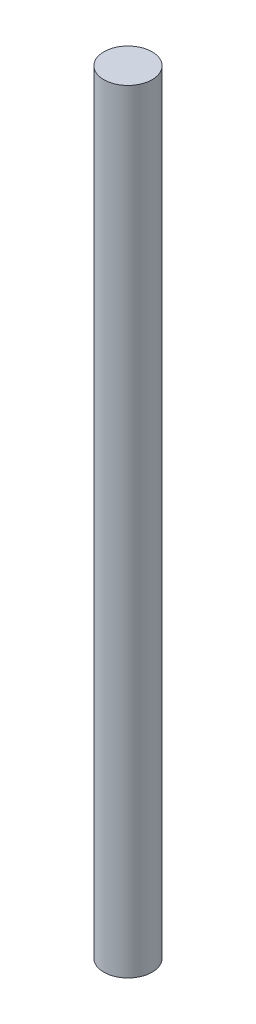
ISO-10303-21;
HEADER;
FILE_DESCRIPTION(('STEP AP214'),'2;1');
FILE_NAME('part.step','',(''),(''),'','','');
FILE_SCHEMA(('AUTOMOTIVE_DESIGN { 1 0 10303 214 1 1 1 1 }'));
ENDSEC;
DATA;
#1=APPLICATION_CONTEXT('core data for automotive mechanical design processes');
#2=APPLICATION_PROTOCOL_DEFINITION('international standard','automotive_design',2000,#1);
#3=PRODUCT_CONTEXT('',#1,'mechanical');
#4=PRODUCT('Part','Part','',(#3));
#5=PRODUCT_RELATED_PRODUCT_CATEGORY('part','',(#4));
#6=PRODUCT_DEFINITION_FORMATION('','',#4);
#7=PRODUCT_DEFINITION_CONTEXT('part definition',#1,'design');
#8=PRODUCT_DEFINITION('design','',#6,#7);
#9=PRODUCT_DEFINITION_SHAPE('','',#8);
#10=(LENGTH_UNIT() NAMED_UNIT(*) SI_UNIT(.MILLI.,.METRE.));
#11=(NAMED_UNIT(*) PLANE_ANGLE_UNIT() SI_UNIT($,.RADIAN.));
#12=(NAMED_UNIT(*) SI_UNIT($,.STERADIAN.) SOLID_ANGLE_UNIT());
#13=UNCERTAINTY_MEASURE_WITH_UNIT(LENGTH_MEASURE(1.E-05),#10,'distance_accuracy_value','');
#14=(GEOMETRIC_REPRESENTATION_CONTEXT(3) GLOBAL_UNCERTAINTY_ASSIGNED_CONTEXT((#13)) GLOBAL_UNIT_ASSIGNED_CONTEXT((#10,
#11,#12)) REPRESENTATION_CONTEXT('',''));
#15=CARTESIAN_POINT('',(0.,0.,0.));
#16=DIRECTION('',(0.,0.,1.));
#17=DIRECTION('',(1.,0.,0.));
#18=AXIS2_PLACEMENT_3D('',#15,#16,#17);
#19=CARTESIAN_POINT('',(0.,3200.,0.));
#20=DIRECTION('',(0.,-1.,0.));
#21=DIRECTION('',(0.,0.,-1.));
#22=AXIS2_PLACEMENT_3D('',#19,#20,#21);
#23=CYLINDRICAL_SURFACE('',#22,100.);
#24=CARTESIAN_POINT('',(0.,3200.,0.));
#25=DIRECTION('',(0.,1.,0.));
#26=DIRECTION('',(0.,0.,1.));
#27=AXIS2_PLACEMENT_3D('',#24,#25,#26);
#28=CIRCLE('',#27,100.);
#29=CARTESIAN_POINT('',(0.,3200.,100.));
#30=VERTEX_POINT('',#29);
#31=EDGE_CURVE('E10',#30,#30,#28,.T.);
#32=ORIENTED_EDGE('',*,*,#31,.F.);
#33=EDGE_LOOP('',(#32));
#34=FACE_BOUND('',#33,.T.);
#35=CARTESIAN_POINT('',(0.,0.,0.));
#36=DIRECTION('',(0.,1.,0.));
#37=DIRECTION('',(0.,0.,1.));
#38=AXIS2_PLACEMENT_3D('',#35,#36,#37);
#39=CIRCLE('',#38,100.);
#40=CARTESIAN_POINT('',(0.,0.,100.));
#41=VERTEX_POINT('',#40);
#42=EDGE_CURVE('E34',#41,#41,#39,.T.);
#43=ORIENTED_EDGE('',*,*,#42,.T.);
#44=EDGE_LOOP('',(#43));
#45=FACE_BOUND('',#44,.T.);
#46=ADVANCED_FACE('F31',(#34,#45),#23,.T.);
#47=CARTESIAN_POINT('',(0.,3200.,0.));
#48=DIRECTION('',(0.,1.,0.));
#49=DIRECTION('',(0.,0.,1.));
#50=AXIS2_PLACEMENT_3D('',#47,#48,#49);
#51=PLANE('',#50);
#52=ORIENTED_EDGE('',*,*,#31,.T.);
#53=EDGE_LOOP('',(#52));
#54=FACE_BOUND('',#53,.T.);
#55=ADVANCED_FACE('F46',(#54),#51,.T.);
#56=CARTESIAN_POINT('',(0.,0.,0.));
#57=DIRECTION('',(0.,1.,0.));
#58=DIRECTION('',(0.,0.,1.));
#59=AXIS2_PLACEMENT_3D('',#56,#57,#58);
#60=PLANE('',#59);
#61=ORIENTED_EDGE('',*,*,#42,.F.);
#62=EDGE_LOOP('',(#61));
#63=FACE_BOUND('',#62,.T.);
#64=ADVANCED_FACE('F44',(#63),#60,.F.);
#65=CLOSED_SHELL('',(#46,#55,#64));
#66=MANIFOLD_SOLID_BREP('B2',#65);
#67=ADVANCED_BREP_SHAPE_REPRESENTATION('',(#18,#66),#14);
#68=SHAPE_DEFINITION_REPRESENTATION(#9,#67);
ENDSEC;
END-ISO-10303-21;
